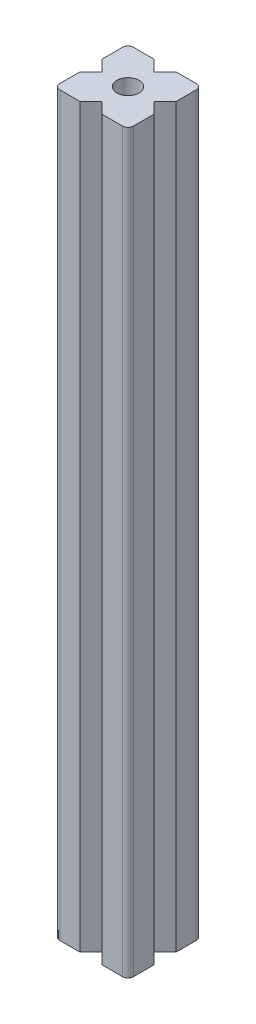
ISO-10303-21;
HEADER;
FILE_DESCRIPTION(('STEP AP214'),'2;1');
FILE_NAME('part.step','',(''),(''),'','','');
FILE_SCHEMA(('AUTOMOTIVE_DESIGN { 1 0 10303 214 1 1 1 1 }'));
ENDSEC;
DATA;
#1=APPLICATION_CONTEXT('core data for automotive mechanical design processes');
#2=APPLICATION_PROTOCOL_DEFINITION('international standard','automotive_design',2000,#1);
#3=PRODUCT_CONTEXT('',#1,'mechanical');
#4=PRODUCT('Part','Part','',(#3));
#5=PRODUCT_RELATED_PRODUCT_CATEGORY('part','',(#4));
#6=PRODUCT_DEFINITION_FORMATION('','',#4);
#7=PRODUCT_DEFINITION_CONTEXT('part definition',#1,'design');
#8=PRODUCT_DEFINITION('design','',#6,#7);
#9=PRODUCT_DEFINITION_SHAPE('','',#8);
#10=(LENGTH_UNIT() NAMED_UNIT(*) SI_UNIT(.MILLI.,.METRE.));
#11=(NAMED_UNIT(*) PLANE_ANGLE_UNIT() SI_UNIT($,.RADIAN.));
#12=(NAMED_UNIT(*) SI_UNIT($,.STERADIAN.) SOLID_ANGLE_UNIT());
#13=UNCERTAINTY_MEASURE_WITH_UNIT(LENGTH_MEASURE(1.E-05),#10,'distance_accuracy_value','');
#14=(GEOMETRIC_REPRESENTATION_CONTEXT(3) GLOBAL_UNCERTAINTY_ASSIGNED_CONTEXT((#13)) GLOBAL_UNIT_ASSIGNED_CONTEXT((#10,
#11,#12)) REPRESENTATION_CONTEXT('',''));
#15=CARTESIAN_POINT('',(0.,0.,0.));
#16=DIRECTION('',(0.,0.,1.));
#17=DIRECTION('',(1.,0.,0.));
#18=AXIS2_PLACEMENT_3D('',#15,#16,#17);
#19=CARTESIAN_POINT('',(0.,200.,0.));
#20=DIRECTION('',(1.,0.,0.));
#21=DIRECTION('',(0.,0.,-1.));
#22=AXIS2_PLACEMENT_3D('',#19,#20,#21);
#23=PLANE('',#22);
#24=DIRECTION('',(0.,0.,1.));
#25=VECTOR('',#24,1.);
#26=CARTESIAN_POINT('',(0.,0.,0.));
#27=LINE('',#26,#25);
#28=CARTESIAN_POINT('',(0.,0.,-7.));
#29=VERTEX_POINT('',#28);
#30=CARTESIAN_POINT('',(0.,0.,-1.5));
#31=VERTEX_POINT('',#30);
#32=EDGE_CURVE('E305',#29,#31,#27,.T.);
#33=ORIENTED_EDGE('',*,*,#32,.T.);
#34=DIRECTION('',(0.,-1.,0.));
#35=VECTOR('',#34,1.);
#36=CARTESIAN_POINT('',(0.,200.,-1.5));
#37=LINE('',#36,#35);
#38=CARTESIAN_POINT('',(0.,200.,-1.5));
#39=VERTEX_POINT('',#38);
#40=EDGE_CURVE('E11',#31,#39,#37,.F.);
#41=ORIENTED_EDGE('',*,*,#40,.T.);
#42=DIRECTION('',(0.,0.,1.));
#43=VECTOR('',#42,1.);
#44=CARTESIAN_POINT('',(0.,200.,0.));
#45=LINE('',#44,#43);
#46=CARTESIAN_POINT('',(0.,200.,-7.));
#47=VERTEX_POINT('',#46);
#48=EDGE_CURVE('E232',#47,#39,#45,.T.);
#49=ORIENTED_EDGE('',*,*,#48,.F.);
#50=DIRECTION('',(0.,1.,0.));
#51=VECTOR('',#50,1.);
#52=CARTESIAN_POINT('',(0.,0.,-7.));
#53=LINE('',#52,#51);
#54=EDGE_CURVE('E347',#29,#47,#53,.T.);
#55=ORIENTED_EDGE('',*,*,#54,.F.);
#56=EDGE_LOOP('',(#33,#41,#49,#55));
#57=FACE_BOUND('',#56,.T.);
#58=ADVANCED_FACE('F57',(#57),#23,.F.);
#59=CARTESIAN_POINT('',(0.,200.,0.));
#60=DIRECTION('',(0.,0.,-1.));
#61=DIRECTION('',(-1.,0.,0.));
#62=AXIS2_PLACEMENT_3D('',#59,#60,#61);
#63=PLANE('',#62);
#64=DIRECTION('',(1.,0.,0.));
#65=VECTOR('',#64,1.);
#66=CARTESIAN_POINT('',(0.,200.,0.));
#67=LINE('',#66,#65);
#68=CARTESIAN_POINT('',(1.5,200.,0.));
#69=VERTEX_POINT('',#68);
#70=CARTESIAN_POINT('',(7.,200.,0.));
#71=VERTEX_POINT('',#70);
#72=EDGE_CURVE('E285',#69,#71,#67,.T.);
#73=ORIENTED_EDGE('',*,*,#72,.F.);
#74=DIRECTION('',(0.,-1.,0.));
#75=VECTOR('',#74,1.);
#76=CARTESIAN_POINT('',(1.5,200.,0.));
#77=LINE('',#76,#75);
#78=CARTESIAN_POINT('',(1.5,0.,0.));
#79=VERTEX_POINT('',#78);
#80=EDGE_CURVE('E65',#69,#79,#77,.T.);
#81=ORIENTED_EDGE('',*,*,#80,.T.);
#82=DIRECTION('',(1.,0.,0.));
#83=VECTOR('',#82,1.);
#84=CARTESIAN_POINT('',(0.,0.,0.));
#85=LINE('',#84,#83);
#86=CARTESIAN_POINT('',(7.,0.,0.));
#87=VERTEX_POINT('',#86);
#88=EDGE_CURVE('E283',#79,#87,#85,.T.);
#89=ORIENTED_EDGE('',*,*,#88,.T.);
#90=DIRECTION('',(0.,1.,0.));
#91=VECTOR('',#90,1.);
#92=CARTESIAN_POINT('',(7.,0.,0.));
#93=LINE('',#92,#91);
#94=EDGE_CURVE('E316',#87,#71,#93,.T.);
#95=ORIENTED_EDGE('',*,*,#94,.T.);
#96=EDGE_LOOP('',(#73,#81,#89,#95));
#97=FACE_BOUND('',#96,.T.);
#98=ADVANCED_FACE('F281',(#97),#63,.F.);
#99=CARTESIAN_POINT('',(20.,200.,0.));
#100=DIRECTION('',(-1.,0.,0.));
#101=DIRECTION('',(0.,0.,1.));
#102=AXIS2_PLACEMENT_3D('',#99,#100,#101);
#103=PLANE('',#102);
#104=DIRECTION('',(0.,0.,-1.));
#105=VECTOR('',#104,1.);
#106=CARTESIAN_POINT('',(20.,200.,0.));
#107=LINE('',#106,#105);
#108=CARTESIAN_POINT('',(20.,200.,-1.5));
#109=VERTEX_POINT('',#108);
#110=CARTESIAN_POINT('',(20.,200.,-7.));
#111=VERTEX_POINT('',#110);
#112=EDGE_CURVE('E307',#109,#111,#107,.T.);
#113=ORIENTED_EDGE('',*,*,#112,.F.);
#114=DIRECTION('',(0.,-1.,0.));
#115=VECTOR('',#114,1.);
#116=CARTESIAN_POINT('',(20.,200.,-1.5));
#117=LINE('',#116,#115);
#118=CARTESIAN_POINT('',(20.,0.,-1.5));
#119=VERTEX_POINT('',#118);
#120=EDGE_CURVE('E238',#109,#119,#117,.T.);
#121=ORIENTED_EDGE('',*,*,#120,.T.);
#122=DIRECTION('',(0.,0.,-1.));
#123=VECTOR('',#122,1.);
#124=CARTESIAN_POINT('',(20.,0.,0.));
#125=LINE('',#124,#123);
#126=CARTESIAN_POINT('',(20.,0.,-7.));
#127=VERTEX_POINT('',#126);
#128=EDGE_CURVE('E226',#119,#127,#125,.T.);
#129=ORIENTED_EDGE('',*,*,#128,.T.);
#130=DIRECTION('',(0.,1.,0.));
#131=VECTOR('',#130,1.);
#132=CARTESIAN_POINT('',(20.,0.,-7.));
#133=LINE('',#132,#131);
#134=EDGE_CURVE('E372',#127,#111,#133,.T.);
#135=ORIENTED_EDGE('',*,*,#134,.T.);
#136=EDGE_LOOP('',(#113,#121,#129,#135));
#137=FACE_BOUND('',#136,.T.);
#138=ADVANCED_FACE('F435',(#137),#103,.F.);
#139=CARTESIAN_POINT('',(0.,200.,-20.));
#140=DIRECTION('',(0.,0.,1.));
#141=DIRECTION('',(1.,0.,0.));
#142=AXIS2_PLACEMENT_3D('',#139,#140,#141);
#143=PLANE('',#142);
#144=DIRECTION('',(-1.,0.,0.));
#145=VECTOR('',#144,1.);
#146=CARTESIAN_POINT('',(0.,200.,-20.));
#147=LINE('',#146,#145);
#148=CARTESIAN_POINT('',(18.5,200.,-20.));
#149=VERTEX_POINT('',#148);
#150=CARTESIAN_POINT('',(13.,200.,-20.));
#151=VERTEX_POINT('',#150);
#152=EDGE_CURVE('E243',#149,#151,#147,.T.);
#153=ORIENTED_EDGE('',*,*,#152,.F.);
#154=DIRECTION('',(0.,-1.,0.));
#155=VECTOR('',#154,1.);
#156=CARTESIAN_POINT('',(18.5,200.,-20.));
#157=LINE('',#156,#155);
#158=CARTESIAN_POINT('',(18.5,0.,-20.));
#159=VERTEX_POINT('',#158);
#160=EDGE_CURVE('E263',#149,#159,#157,.T.);
#161=ORIENTED_EDGE('',*,*,#160,.T.);
#162=DIRECTION('',(-1.,0.,0.));
#163=VECTOR('',#162,1.);
#164=CARTESIAN_POINT('',(0.,0.,-20.));
#165=LINE('',#164,#163);
#166=CARTESIAN_POINT('',(13.,0.,-20.));
#167=VERTEX_POINT('',#166);
#168=EDGE_CURVE('E225',#159,#167,#165,.T.);
#169=ORIENTED_EDGE('',*,*,#168,.T.);
#170=DIRECTION('',(0.,1.,0.));
#171=VECTOR('',#170,1.);
#172=CARTESIAN_POINT('',(13.,0.,-20.));
#173=LINE('',#172,#171);
#174=EDGE_CURVE('E393',#167,#151,#173,.T.);
#175=ORIENTED_EDGE('',*,*,#174,.T.);
#176=EDGE_LOOP('',(#153,#161,#169,#175));
#177=FACE_BOUND('',#176,.T.);
#178=ADVANCED_FACE('F518',(#177),#143,.F.);
#179=CARTESIAN_POINT('',(0.,200.,-18.5));
#180=VERTEX_POINT('',#179);
#181=CARTESIAN_POINT('',(0.,200.,-13.));
#182=VERTEX_POINT('',#181);
#183=EDGE_CURVE('E313',#180,#182,#45,.T.);
#184=ORIENTED_EDGE('',*,*,#183,.F.);
#185=DIRECTION('',(0.,-1.,0.));
#186=VECTOR('',#185,1.);
#187=CARTESIAN_POINT('',(0.,200.,-18.5));
#188=LINE('',#187,#186);
#189=CARTESIAN_POINT('',(0.,0.,-18.5));
#190=VERTEX_POINT('',#189);
#191=EDGE_CURVE('E269',#180,#190,#188,.T.);
#192=ORIENTED_EDGE('',*,*,#191,.T.);
#193=CARTESIAN_POINT('',(0.,0.,-13.));
#194=VERTEX_POINT('',#193);
#195=EDGE_CURVE('E301',#190,#194,#27,.T.);
#196=ORIENTED_EDGE('',*,*,#195,.T.);
#197=DIRECTION('',(0.,1.,0.));
#198=VECTOR('',#197,1.);
#199=CARTESIAN_POINT('',(0.,0.,-13.));
#200=LINE('',#199,#198);
#201=EDGE_CURVE('E342',#194,#182,#200,.T.);
#202=ORIENTED_EDGE('',*,*,#201,.T.);
#203=EDGE_LOOP('',(#184,#192,#196,#202));
#204=FACE_BOUND('',#203,.T.);
#205=ADVANCED_FACE('F506',(#204),#23,.F.);
#206=CARTESIAN_POINT('',(13.,0.,0.));
#207=VERTEX_POINT('',#206);
#208=CARTESIAN_POINT('',(18.5,0.,0.));
#209=VERTEX_POINT('',#208);
#210=EDGE_CURVE('E293',#207,#209,#85,.T.);
#211=ORIENTED_EDGE('',*,*,#210,.T.);
#212=DIRECTION('',(0.,-1.,0.));
#213=VECTOR('',#212,1.);
#214=CARTESIAN_POINT('',(18.5,200.,0.));
#215=LINE('',#214,#213);
#216=CARTESIAN_POINT('',(18.5,200.,0.));
#217=VERTEX_POINT('',#216);
#218=EDGE_CURVE('E250',#209,#217,#215,.F.);
#219=ORIENTED_EDGE('',*,*,#218,.T.);
#220=CARTESIAN_POINT('',(13.,200.,0.));
#221=VERTEX_POINT('',#220);
#222=EDGE_CURVE('E312',#221,#217,#67,.T.);
#223=ORIENTED_EDGE('',*,*,#222,.F.);
#224=DIRECTION('',(0.,1.,0.));
#225=VECTOR('',#224,1.);
#226=CARTESIAN_POINT('',(13.,0.,0.));
#227=LINE('',#226,#225);
#228=EDGE_CURVE('E319',#207,#221,#227,.T.);
#229=ORIENTED_EDGE('',*,*,#228,.F.);
#230=EDGE_LOOP('',(#211,#219,#223,#229));
#231=FACE_BOUND('',#230,.T.);
#232=ADVANCED_FACE('F517',(#231),#63,.F.);
#233=CARTESIAN_POINT('',(20.,0.,-13.));
#234=VERTEX_POINT('',#233);
#235=CARTESIAN_POINT('',(20.,0.,-18.5));
#236=VERTEX_POINT('',#235);
#237=EDGE_CURVE('E234',#234,#236,#125,.T.);
#238=ORIENTED_EDGE('',*,*,#237,.T.);
#239=DIRECTION('',(0.,-1.,0.));
#240=VECTOR('',#239,1.);
#241=CARTESIAN_POINT('',(20.,200.,-18.5));
#242=LINE('',#241,#240);
#243=CARTESIAN_POINT('',(20.,200.,-18.5));
#244=VERTEX_POINT('',#243);
#245=EDGE_CURVE('E72',#236,#244,#242,.F.);
#246=ORIENTED_EDGE('',*,*,#245,.T.);
#247=CARTESIAN_POINT('',(20.,200.,-13.));
#248=VERTEX_POINT('',#247);
#249=EDGE_CURVE('E310',#248,#244,#107,.T.);
#250=ORIENTED_EDGE('',*,*,#249,.F.);
#251=DIRECTION('',(0.,1.,0.));
#252=VECTOR('',#251,1.);
#253=CARTESIAN_POINT('',(20.,0.,-13.));
#254=LINE('',#253,#252);
#255=EDGE_CURVE('E365',#234,#248,#254,.T.);
#256=ORIENTED_EDGE('',*,*,#255,.F.);
#257=EDGE_LOOP('',(#238,#246,#250,#256));
#258=FACE_BOUND('',#257,.T.);
#259=ADVANCED_FACE('F448',(#258),#103,.F.);
#260=CARTESIAN_POINT('',(7.,0.,-20.));
#261=VERTEX_POINT('',#260);
#262=CARTESIAN_POINT('',(1.5,0.,-20.));
#263=VERTEX_POINT('',#262);
#264=EDGE_CURVE('E214',#261,#263,#165,.T.);
#265=ORIENTED_EDGE('',*,*,#264,.T.);
#266=DIRECTION('',(0.,-1.,0.));
#267=VECTOR('',#266,1.);
#268=CARTESIAN_POINT('',(1.5,200.,-20.));
#269=LINE('',#268,#267);
#270=CARTESIAN_POINT('',(1.5,200.,-20.));
#271=VERTEX_POINT('',#270);
#272=EDGE_CURVE('E273',#263,#271,#269,.F.);
#273=ORIENTED_EDGE('',*,*,#272,.T.);
#274=CARTESIAN_POINT('',(7.,200.,-20.));
#275=VERTEX_POINT('',#274);
#276=EDGE_CURVE('E217',#275,#271,#147,.T.);
#277=ORIENTED_EDGE('',*,*,#276,.F.);
#278=DIRECTION('',(0.,1.,0.));
#279=VECTOR('',#278,1.);
#280=CARTESIAN_POINT('',(7.,0.,-20.));
#281=LINE('',#280,#279);
#282=EDGE_CURVE('E200',#261,#275,#281,.T.);
#283=ORIENTED_EDGE('',*,*,#282,.F.);
#284=EDGE_LOOP('',(#265,#273,#277,#283));
#285=FACE_BOUND('',#284,.T.);
#286=ADVANCED_FACE('F213',(#285),#143,.F.);
#287=CARTESIAN_POINT('',(0.,200.,0.));
#288=DIRECTION('',(0.,-1.,0.));
#289=DIRECTION('',(0.,0.,-1.));
#290=AXIS2_PLACEMENT_3D('',#287,#288,#289);
#291=PLANE('',#290);
#292=CARTESIAN_POINT('',(10.,200.,-10.));
#293=DIRECTION('',(0.,1.,0.));
#294=DIRECTION('',(0.,0.,1.));
#295=AXIS2_PLACEMENT_3D('',#292,#293,#294);
#296=CIRCLE('',#295,3.);
#297=CARTESIAN_POINT('',(10.,200.,-7.));
#298=VERTEX_POINT('',#297);
#299=EDGE_CURVE('E404',#298,#298,#296,.T.);
#300=ORIENTED_EDGE('',*,*,#299,.F.);
#301=EDGE_LOOP('',(#300));
#302=FACE_BOUND('',#301,.T.);
#303=ORIENTED_EDGE('',*,*,#222,.T.);
#304=CARTESIAN_POINT('',(18.5,200.,-1.5));
#305=DIRECTION('',(0.,-1.,0.));
#306=DIRECTION('',(0.,0.,-1.));
#307=AXIS2_PLACEMENT_3D('',#304,#305,#306);
#308=CIRCLE('',#307,1.5);
#309=EDGE_CURVE('E260',#217,#109,#308,.F.);
#310=ORIENTED_EDGE('',*,*,#309,.T.);
#311=ORIENTED_EDGE('',*,*,#112,.T.);
#312=DIRECTION('',(0.707106781186548,0.,0.707106781186547));
#313=VECTOR('',#312,1.);
#314=CARTESIAN_POINT('',(20.,200.,-7.));
#315=LINE('',#314,#313);
#316=CARTESIAN_POINT('',(17.,200.,-10.));
#317=VERTEX_POINT('',#316);
#318=EDGE_CURVE('E377',#317,#111,#315,.T.);
#319=ORIENTED_EDGE('',*,*,#318,.F.);
#320=DIRECTION('',(-0.707106781186547,0.,0.707106781186548));
#321=VECTOR('',#320,1.);
#322=CARTESIAN_POINT('',(20.,200.,-13.));
#323=LINE('',#322,#321);
#324=EDGE_CURVE('E350',#248,#317,#323,.T.);
#325=ORIENTED_EDGE('',*,*,#324,.F.);
#326=ORIENTED_EDGE('',*,*,#249,.T.);
#327=CARTESIAN_POINT('',(18.5,200.,-18.5));
#328=DIRECTION('',(0.,-1.,0.));
#329=DIRECTION('',(0.,0.,-1.));
#330=AXIS2_PLACEMENT_3D('',#327,#328,#329);
#331=CIRCLE('',#330,1.5);
#332=EDGE_CURVE('E258',#244,#149,#331,.F.);
#333=ORIENTED_EDGE('',*,*,#332,.T.);
#334=ORIENTED_EDGE('',*,*,#152,.T.);
#335=DIRECTION('',(0.707106781186548,0.,-0.707106781186547));
#336=VECTOR('',#335,1.);
#337=CARTESIAN_POINT('',(13.,200.,-20.));
#338=LINE('',#337,#336);
#339=CARTESIAN_POINT('',(10.,200.,-17.));
#340=VERTEX_POINT('',#339);
#341=EDGE_CURVE('E208',#340,#151,#338,.T.);
#342=ORIENTED_EDGE('',*,*,#341,.F.);
#343=DIRECTION('',(0.707106781186548,0.,0.707106781186547));
#344=VECTOR('',#343,1.);
#345=CARTESIAN_POINT('',(7.,200.,-20.));
#346=LINE('',#345,#344);
#347=EDGE_CURVE('E376',#275,#340,#346,.T.);
#348=ORIENTED_EDGE('',*,*,#347,.F.);
#349=ORIENTED_EDGE('',*,*,#276,.T.);
#350=CARTESIAN_POINT('',(1.5,200.,-18.5));
#351=DIRECTION('',(0.,-1.,0.));
#352=DIRECTION('',(0.,0.,-1.));
#353=AXIS2_PLACEMENT_3D('',#350,#351,#352);
#354=CIRCLE('',#353,1.5);
#355=EDGE_CURVE('E255',#271,#180,#354,.F.);
#356=ORIENTED_EDGE('',*,*,#355,.T.);
#357=ORIENTED_EDGE('',*,*,#183,.T.);
#358=DIRECTION('',(-0.707106781186547,0.,-0.707106781186548));
#359=VECTOR('',#358,1.);
#360=CARTESIAN_POINT('',(0.,200.,-13.));
#361=LINE('',#360,#359);
#362=CARTESIAN_POINT('',(2.99999999999999,200.,-10.));
#363=VERTEX_POINT('',#362);
#364=EDGE_CURVE('E351',#363,#182,#361,.T.);
#365=ORIENTED_EDGE('',*,*,#364,.F.);
#366=DIRECTION('',(0.707106781186548,0.,-0.707106781186547));
#367=VECTOR('',#366,1.);
#368=CARTESIAN_POINT('',(0.,200.,-7.));
#369=LINE('',#368,#367);
#370=EDGE_CURVE('E326',#47,#363,#369,.T.);
#371=ORIENTED_EDGE('',*,*,#370,.F.);
#372=ORIENTED_EDGE('',*,*,#48,.T.);
#373=CARTESIAN_POINT('',(1.5,200.,-1.5));
#374=DIRECTION('',(0.,-1.,0.));
#375=DIRECTION('',(0.,0.,-1.));
#376=AXIS2_PLACEMENT_3D('',#373,#374,#375);
#377=CIRCLE('',#376,1.5);
#378=EDGE_CURVE('E80',#39,#69,#377,.F.);
#379=ORIENTED_EDGE('',*,*,#378,.T.);
#380=ORIENTED_EDGE('',*,*,#72,.T.);
#381=DIRECTION('',(-0.707106781186547,0.,0.707106781186548));
#382=VECTOR('',#381,1.);
#383=CARTESIAN_POINT('',(7.,200.,0.));
#384=LINE('',#383,#382);
#385=CARTESIAN_POINT('',(10.,200.,-3.));
#386=VERTEX_POINT('',#385);
#387=EDGE_CURVE('E331',#386,#71,#384,.T.);
#388=ORIENTED_EDGE('',*,*,#387,.F.);
#389=DIRECTION('',(-0.707106781186547,0.,-0.707106781186548));
#390=VECTOR('',#389,1.);
#391=CARTESIAN_POINT('',(13.,200.,0.));
#392=LINE('',#391,#390);
#393=EDGE_CURVE('E327',#221,#386,#392,.T.);
#394=ORIENTED_EDGE('',*,*,#393,.F.);
#395=EDGE_LOOP('',(#303,#310,#311,#319,#325,#326,#333,#334,#342,#348,#349,#356,#357,#365,#371,
#372,#379,#380,#388,#394));
#396=FACE_BOUND('',#395,.T.);
#397=ADVANCED_FACE('F419',(#302,#396),#291,.F.);
#398=CARTESIAN_POINT('',(0.,0.,0.));
#399=DIRECTION('',(0.,-1.,0.));
#400=DIRECTION('',(0.,0.,-1.));
#401=AXIS2_PLACEMENT_3D('',#398,#399,#400);
#402=PLANE('',#401);
#403=CARTESIAN_POINT('',(10.,0.,-10.));
#404=DIRECTION('',(0.,1.,0.));
#405=DIRECTION('',(0.,0.,1.));
#406=AXIS2_PLACEMENT_3D('',#403,#404,#405);
#407=CIRCLE('',#406,3.);
#408=CARTESIAN_POINT('',(10.,0.,-7.));
#409=VERTEX_POINT('',#408);
#410=EDGE_CURVE('E335',#409,#409,#407,.T.);
#411=ORIENTED_EDGE('',*,*,#410,.T.);
#412=EDGE_LOOP('',(#411));
#413=FACE_BOUND('',#412,.T.);
#414=ORIENTED_EDGE('',*,*,#128,.F.);
#415=CARTESIAN_POINT('',(18.5,0.,-1.5));
#416=DIRECTION('',(0.,-1.,0.));
#417=DIRECTION('',(0.,0.,-1.));
#418=AXIS2_PLACEMENT_3D('',#415,#416,#417);
#419=CIRCLE('',#418,1.5);
#420=EDGE_CURVE('E248',#119,#209,#419,.T.);
#421=ORIENTED_EDGE('',*,*,#420,.T.);
#422=ORIENTED_EDGE('',*,*,#210,.F.);
#423=DIRECTION('',(-0.707106781186547,0.,-0.707106781186548));
#424=VECTOR('',#423,1.);
#425=CARTESIAN_POINT('',(13.,0.,0.));
#426=LINE('',#425,#424);
#427=CARTESIAN_POINT('',(10.,0.,-3.));
#428=VERTEX_POINT('',#427);
#429=EDGE_CURVE('E320',#207,#428,#426,.T.);
#430=ORIENTED_EDGE('',*,*,#429,.T.);
#431=DIRECTION('',(-0.707106781186547,0.,0.707106781186548));
#432=VECTOR('',#431,1.);
#433=CARTESIAN_POINT('',(7.,0.,0.));
#434=LINE('',#433,#432);
#435=EDGE_CURVE('E291',#428,#87,#434,.T.);
#436=ORIENTED_EDGE('',*,*,#435,.T.);
#437=ORIENTED_EDGE('',*,*,#88,.F.);
#438=CARTESIAN_POINT('',(1.5,0.,-1.5));
#439=DIRECTION('',(0.,-1.,0.));
#440=DIRECTION('',(0.,0.,-1.));
#441=AXIS2_PLACEMENT_3D('',#438,#439,#440);
#442=CIRCLE('',#441,1.5);
#443=EDGE_CURVE('E242',#79,#31,#442,.T.);
#444=ORIENTED_EDGE('',*,*,#443,.T.);
#445=ORIENTED_EDGE('',*,*,#32,.F.);
#446=DIRECTION('',(0.707106781186548,0.,-0.707106781186547));
#447=VECTOR('',#446,1.);
#448=CARTESIAN_POINT('',(0.,0.,-7.));
#449=LINE('',#448,#447);
#450=CARTESIAN_POINT('',(2.99999999999999,0.,-10.));
#451=VERTEX_POINT('',#450);
#452=EDGE_CURVE('E355',#29,#451,#449,.T.);
#453=ORIENTED_EDGE('',*,*,#452,.T.);
#454=DIRECTION('',(-0.707106781186547,0.,-0.707106781186548));
#455=VECTOR('',#454,1.);
#456=CARTESIAN_POINT('',(0.,0.,-13.));
#457=LINE('',#456,#455);
#458=EDGE_CURVE('E343',#451,#194,#457,.T.);
#459=ORIENTED_EDGE('',*,*,#458,.T.);
#460=ORIENTED_EDGE('',*,*,#195,.F.);
#461=CARTESIAN_POINT('',(1.5,0.,-18.5));
#462=DIRECTION('',(0.,-1.,0.));
#463=DIRECTION('',(0.,0.,-1.));
#464=AXIS2_PLACEMENT_3D('',#461,#462,#463);
#465=CIRCLE('',#464,1.5);
#466=EDGE_CURVE('E223',#190,#263,#465,.T.);
#467=ORIENTED_EDGE('',*,*,#466,.T.);
#468=ORIENTED_EDGE('',*,*,#264,.F.);
#469=DIRECTION('',(0.707106781186548,0.,0.707106781186547));
#470=VECTOR('',#469,1.);
#471=CARTESIAN_POINT('',(7.,0.,-20.));
#472=LINE('',#471,#470);
#473=CARTESIAN_POINT('',(10.,0.,-17.));
#474=VERTEX_POINT('',#473);
#475=EDGE_CURVE('E196',#261,#474,#472,.T.);
#476=ORIENTED_EDGE('',*,*,#475,.T.);
#477=DIRECTION('',(0.707106781186548,0.,-0.707106781186547));
#478=VECTOR('',#477,1.);
#479=CARTESIAN_POINT('',(13.,0.,-20.));
#480=LINE('',#479,#478);
#481=EDGE_CURVE('E207',#474,#167,#480,.T.);
#482=ORIENTED_EDGE('',*,*,#481,.T.);
#483=ORIENTED_EDGE('',*,*,#168,.F.);
#484=CARTESIAN_POINT('',(18.5,0.,-18.5));
#485=DIRECTION('',(0.,-1.,0.));
#486=DIRECTION('',(0.,0.,-1.));
#487=AXIS2_PLACEMENT_3D('',#484,#485,#486);
#488=CIRCLE('',#487,1.5);
#489=EDGE_CURVE('E246',#159,#236,#488,.T.);
#490=ORIENTED_EDGE('',*,*,#489,.T.);
#491=ORIENTED_EDGE('',*,*,#237,.F.);
#492=DIRECTION('',(-0.707106781186547,0.,0.707106781186548));
#493=VECTOR('',#492,1.);
#494=CARTESIAN_POINT('',(20.,0.,-13.));
#495=LINE('',#494,#493);
#496=CARTESIAN_POINT('',(17.,0.,-10.));
#497=VERTEX_POINT('',#496);
#498=EDGE_CURVE('E381',#234,#497,#495,.T.);
#499=ORIENTED_EDGE('',*,*,#498,.T.);
#500=DIRECTION('',(0.707106781186548,0.,0.707106781186547));
#501=VECTOR('',#500,1.);
#502=CARTESIAN_POINT('',(20.,0.,-7.));
#503=LINE('',#502,#501);
#504=EDGE_CURVE('E369',#497,#127,#503,.T.);
#505=ORIENTED_EDGE('',*,*,#504,.T.);
#506=EDGE_LOOP('',(#414,#421,#422,#430,#436,#437,#444,#445,#453,#459,#460,#467,#468,#476,#482,
#483,#490,#491,#499,#505));
#507=FACE_BOUND('',#506,.T.);
#508=ADVANCED_FACE('F221',(#413,#507),#402,.T.);
#509=CARTESIAN_POINT('',(7.,0.,0.));
#510=DIRECTION('',(-0.707106781186548,0.,-0.707106781186547));
#511=DIRECTION('',(-0.707106781186547,0.,0.707106781186548));
#512=AXIS2_PLACEMENT_3D('',#509,#510,#511);
#513=PLANE('',#512);
#514=ORIENTED_EDGE('',*,*,#387,.T.);
#515=ORIENTED_EDGE('',*,*,#94,.F.);
#516=ORIENTED_EDGE('',*,*,#435,.F.);
#517=DIRECTION('',(0.,1.,0.));
#518=VECTOR('',#517,1.);
#519=CARTESIAN_POINT('',(10.,0.,-3.));
#520=LINE('',#519,#518);
#521=EDGE_CURVE('E323',#428,#386,#520,.T.);
#522=ORIENTED_EDGE('',*,*,#521,.T.);
#523=EDGE_LOOP('',(#514,#515,#516,#522));
#524=FACE_BOUND('',#523,.T.);
#525=ADVANCED_FACE('F582',(#524),#513,.F.);
#526=CARTESIAN_POINT('',(13.,0.,0.));
#527=DIRECTION('',(0.707106781186548,0.,-0.707106781186547));
#528=DIRECTION('',(-0.707106781186547,0.,-0.707106781186548));
#529=AXIS2_PLACEMENT_3D('',#526,#527,#528);
#530=PLANE('',#529);
#531=ORIENTED_EDGE('',*,*,#393,.T.);
#532=ORIENTED_EDGE('',*,*,#521,.F.);
#533=ORIENTED_EDGE('',*,*,#429,.F.);
#534=ORIENTED_EDGE('',*,*,#228,.T.);
#535=EDGE_LOOP('',(#531,#532,#533,#534));
#536=FACE_BOUND('',#535,.T.);
#537=ADVANCED_FACE('F719',(#536),#530,.F.);
#538=CARTESIAN_POINT('',(0.,0.,-7.));
#539=DIRECTION('',(0.707106781186547,0.,0.707106781186548));
#540=DIRECTION('',(0.707106781186548,0.,-0.707106781186547));
#541=AXIS2_PLACEMENT_3D('',#538,#539,#540);
#542=PLANE('',#541);
#543=ORIENTED_EDGE('',*,*,#370,.T.);
#544=DIRECTION('',(0.,1.,0.));
#545=VECTOR('',#544,1.);
#546=CARTESIAN_POINT('',(2.99999999999999,0.,-10.));
#547=LINE('',#546,#545);
#548=EDGE_CURVE('E340',#451,#363,#547,.T.);
#549=ORIENTED_EDGE('',*,*,#548,.F.);
#550=ORIENTED_EDGE('',*,*,#452,.F.);
#551=ORIENTED_EDGE('',*,*,#54,.T.);
#552=EDGE_LOOP('',(#543,#549,#550,#551));
#553=FACE_BOUND('',#552,.T.);
#554=ADVANCED_FACE('F560',(#553),#542,.F.);
#555=CARTESIAN_POINT('',(0.,0.,-13.));
#556=DIRECTION('',(0.707106781186548,0.,-0.707106781186547));
#557=DIRECTION('',(-0.707106781186547,0.,-0.707106781186548));
#558=AXIS2_PLACEMENT_3D('',#555,#556,#557);
#559=PLANE('',#558);
#560=ORIENTED_EDGE('',*,*,#364,.T.);
#561=ORIENTED_EDGE('',*,*,#201,.F.);
#562=ORIENTED_EDGE('',*,*,#458,.F.);
#563=ORIENTED_EDGE('',*,*,#548,.T.);
#564=EDGE_LOOP('',(#560,#561,#562,#563));
#565=FACE_BOUND('',#564,.T.);
#566=ADVANCED_FACE('F555',(#565),#559,.F.);
#567=CARTESIAN_POINT('',(20.,0.,-7.));
#568=DIRECTION('',(-0.707106781186547,0.,0.707106781186548));
#569=DIRECTION('',(0.707106781186548,0.,0.707106781186547));
#570=AXIS2_PLACEMENT_3D('',#567,#568,#569);
#571=PLANE('',#570);
#572=ORIENTED_EDGE('',*,*,#318,.T.);
#573=ORIENTED_EDGE('',*,*,#134,.F.);
#574=ORIENTED_EDGE('',*,*,#504,.F.);
#575=DIRECTION('',(0.,1.,0.));
#576=VECTOR('',#575,1.);
#577=CARTESIAN_POINT('',(17.,0.,-10.));
#578=LINE('',#577,#576);
#579=EDGE_CURVE('E368',#497,#317,#578,.T.);
#580=ORIENTED_EDGE('',*,*,#579,.T.);
#581=EDGE_LOOP('',(#572,#573,#574,#580));
#582=FACE_BOUND('',#581,.T.);
#583=ADVANCED_FACE('F441',(#582),#571,.F.);
#584=CARTESIAN_POINT('',(20.,0.,-13.));
#585=DIRECTION('',(-0.707106781186548,0.,-0.707106781186547));
#586=DIRECTION('',(-0.707106781186547,0.,0.707106781186548));
#587=AXIS2_PLACEMENT_3D('',#584,#585,#586);
#588=PLANE('',#587);
#589=ORIENTED_EDGE('',*,*,#324,.T.);
#590=ORIENTED_EDGE('',*,*,#579,.F.);
#591=ORIENTED_EDGE('',*,*,#498,.F.);
#592=ORIENTED_EDGE('',*,*,#255,.T.);
#593=EDGE_LOOP('',(#589,#590,#591,#592));
#594=FACE_BOUND('',#593,.T.);
#595=ADVANCED_FACE('F443',(#594),#588,.F.);
#596=CARTESIAN_POINT('',(13.,0.,-20.));
#597=DIRECTION('',(0.707106781186547,0.,0.707106781186548));
#598=DIRECTION('',(0.707106781186548,0.,-0.707106781186547));
#599=AXIS2_PLACEMENT_3D('',#596,#597,#598);
#600=PLANE('',#599);
#601=ORIENTED_EDGE('',*,*,#341,.T.);
#602=ORIENTED_EDGE('',*,*,#174,.F.);
#603=ORIENTED_EDGE('',*,*,#481,.F.);
#604=DIRECTION('',(0.,1.,0.));
#605=VECTOR('',#604,1.);
#606=CARTESIAN_POINT('',(10.,0.,-17.));
#607=LINE('',#606,#605);
#608=EDGE_CURVE('E202',#474,#340,#607,.T.);
#609=ORIENTED_EDGE('',*,*,#608,.T.);
#610=EDGE_LOOP('',(#601,#602,#603,#609));
#611=FACE_BOUND('',#610,.T.);
#612=ADVANCED_FACE('F547',(#611),#600,.F.);
#613=CARTESIAN_POINT('',(7.,0.,-20.));
#614=DIRECTION('',(-0.707106781186547,0.,0.707106781186548));
#615=DIRECTION('',(0.707106781186548,0.,0.707106781186547));
#616=AXIS2_PLACEMENT_3D('',#613,#614,#615);
#617=PLANE('',#616);
#618=ORIENTED_EDGE('',*,*,#347,.T.);
#619=ORIENTED_EDGE('',*,*,#608,.F.);
#620=ORIENTED_EDGE('',*,*,#475,.F.);
#621=ORIENTED_EDGE('',*,*,#282,.T.);
#622=EDGE_LOOP('',(#618,#619,#620,#621));
#623=FACE_BOUND('',#622,.T.);
#624=ADVANCED_FACE('F199',(#623),#617,.F.);
#625=CARTESIAN_POINT('',(10.,0.,-10.));
#626=DIRECTION('',(0.,1.,0.));
#627=DIRECTION('',(0.,0.,1.));
#628=AXIS2_PLACEMENT_3D('',#625,#626,#627);
#629=CYLINDRICAL_SURFACE('',#628,3.);
#630=ORIENTED_EDGE('',*,*,#410,.F.);
#631=EDGE_LOOP('',(#630));
#632=FACE_BOUND('',#631,.T.);
#633=ORIENTED_EDGE('',*,*,#299,.T.);
#634=EDGE_LOOP('',(#633));
#635=FACE_BOUND('',#634,.T.);
#636=ADVANCED_FACE('F412',(#632,#635),#629,.F.);
#637=CARTESIAN_POINT('',(18.5,200.,-1.5));
#638=DIRECTION('',(0.,-1.,0.));
#639=DIRECTION('',(0.,0.,-1.));
#640=AXIS2_PLACEMENT_3D('',#637,#638,#639);
#641=CYLINDRICAL_SURFACE('',#640,1.5);
#642=ORIENTED_EDGE('',*,*,#309,.F.);
#643=ORIENTED_EDGE('',*,*,#218,.F.);
#644=ORIENTED_EDGE('',*,*,#420,.F.);
#645=ORIENTED_EDGE('',*,*,#120,.F.);
#646=EDGE_LOOP('',(#642,#643,#644,#645));
#647=FACE_BOUND('',#646,.T.);
#648=ADVANCED_FACE('F415',(#647),#641,.T.);
#649=CARTESIAN_POINT('',(18.5,200.,-18.5));
#650=DIRECTION('',(0.,-1.,0.));
#651=DIRECTION('',(0.,0.,-1.));
#652=AXIS2_PLACEMENT_3D('',#649,#650,#651);
#653=CYLINDRICAL_SURFACE('',#652,1.5);
#654=ORIENTED_EDGE('',*,*,#332,.F.);
#655=ORIENTED_EDGE('',*,*,#245,.F.);
#656=ORIENTED_EDGE('',*,*,#489,.F.);
#657=ORIENTED_EDGE('',*,*,#160,.F.);
#658=EDGE_LOOP('',(#654,#655,#656,#657));
#659=FACE_BOUND('',#658,.T.);
#660=ADVANCED_FACE('F672',(#659),#653,.T.);
#661=CARTESIAN_POINT('',(1.5,200.,-18.5));
#662=DIRECTION('',(0.,-1.,0.));
#663=DIRECTION('',(0.,0.,-1.));
#664=AXIS2_PLACEMENT_3D('',#661,#662,#663);
#665=CYLINDRICAL_SURFACE('',#664,1.5);
#666=ORIENTED_EDGE('',*,*,#355,.F.);
#667=ORIENTED_EDGE('',*,*,#272,.F.);
#668=ORIENTED_EDGE('',*,*,#466,.F.);
#669=ORIENTED_EDGE('',*,*,#191,.F.);
#670=EDGE_LOOP('',(#666,#667,#668,#669));
#671=FACE_BOUND('',#670,.T.);
#672=ADVANCED_FACE('F680',(#671),#665,.T.);
#673=CARTESIAN_POINT('',(1.5,200.,-1.5));
#674=DIRECTION('',(0.,-1.,0.));
#675=DIRECTION('',(0.,0.,-1.));
#676=AXIS2_PLACEMENT_3D('',#673,#674,#675);
#677=CYLINDRICAL_SURFACE('',#676,1.5);
#678=ORIENTED_EDGE('',*,*,#378,.F.);
#679=ORIENTED_EDGE('',*,*,#40,.F.);
#680=ORIENTED_EDGE('',*,*,#443,.F.);
#681=ORIENTED_EDGE('',*,*,#80,.F.);
#682=EDGE_LOOP('',(#678,#679,#680,#681));
#683=FACE_BOUND('',#682,.T.);
#684=ADVANCED_FACE('F59',(#683),#677,.T.);
#685=CLOSED_SHELL('',(#58,#98,#138,#178,#205,#232,#259,#286,#397,#508,#525,#537,#554,#566,#583,
#595,#612,#624,#636,#648,#660,#672,#684));
#686=MANIFOLD_SOLID_BREP('B2',#685);
#687=ADVANCED_BREP_SHAPE_REPRESENTATION('',(#18,#686),#14);
#688=SHAPE_DEFINITION_REPRESENTATION(#9,#687);
ENDSEC;
END-ISO-10303-21;
